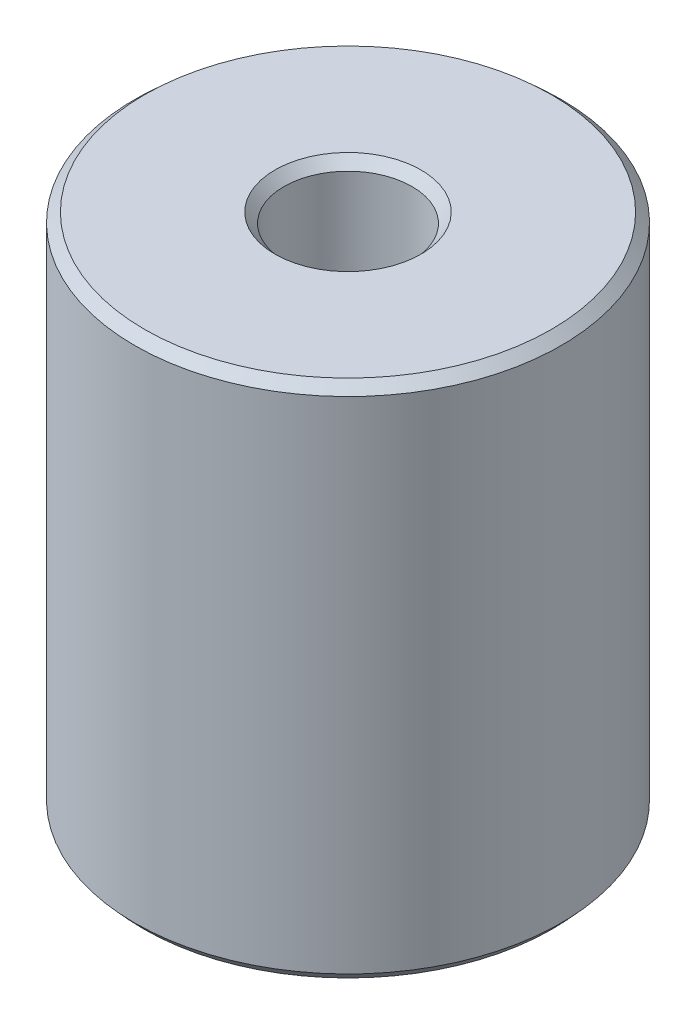
ISO-10303-21;
HEADER;
FILE_DESCRIPTION(('STEP AP214'),'2;1');
FILE_NAME('part.step','',(''),(''),'','','');
FILE_SCHEMA(('AUTOMOTIVE_DESIGN { 1 0 10303 214 1 1 1 1 }'));
ENDSEC;
DATA;
#1=APPLICATION_CONTEXT('core data for automotive mechanical design processes');
#2=APPLICATION_PROTOCOL_DEFINITION('international standard','automotive_design',2000,#1);
#3=PRODUCT_CONTEXT('',#1,'mechanical');
#4=PRODUCT('Part','Part','',(#3));
#5=PRODUCT_RELATED_PRODUCT_CATEGORY('part','',(#4));
#6=PRODUCT_DEFINITION_FORMATION('','',#4);
#7=PRODUCT_DEFINITION_CONTEXT('part definition',#1,'design');
#8=PRODUCT_DEFINITION('design','',#6,#7);
#9=PRODUCT_DEFINITION_SHAPE('','',#8);
#10=(LENGTH_UNIT() NAMED_UNIT(*) SI_UNIT(.MILLI.,.METRE.));
#11=(NAMED_UNIT(*) PLANE_ANGLE_UNIT() SI_UNIT($,.RADIAN.));
#12=(NAMED_UNIT(*) SI_UNIT($,.STERADIAN.) SOLID_ANGLE_UNIT());
#13=UNCERTAINTY_MEASURE_WITH_UNIT(LENGTH_MEASURE(1.E-05),#10,'distance_accuracy_value','');
#14=(GEOMETRIC_REPRESENTATION_CONTEXT(3) GLOBAL_UNCERTAINTY_ASSIGNED_CONTEXT((#13)) GLOBAL_UNIT_ASSIGNED_CONTEXT((#10,
#11,#12)) REPRESENTATION_CONTEXT('',''));
#15=CARTESIAN_POINT('',(0.,0.,0.));
#16=DIRECTION('',(0.,0.,1.));
#17=DIRECTION('',(1.,0.,0.));
#18=AXIS2_PLACEMENT_3D('',#15,#16,#17);
#19=CARTESIAN_POINT('',(0.,12.169899260072,0.));
#20=DIRECTION('',(0.,-1.,0.));
#21=DIRECTION('',(0.,0.,-1.));
#22=AXIS2_PLACEMENT_3D('',#19,#20,#21);
#23=CYLINDRICAL_SURFACE('',#22,5.);
#24=CARTESIAN_POINT('',(0.,0.230903095628844,0.));
#25=DIRECTION('',(0.,1.,0.));
#26=DIRECTION('',(0.,0.,1.));
#27=AXIS2_PLACEMENT_3D('',#24,#25,#26);
#28=CIRCLE('',#27,5.);
#29=CARTESIAN_POINT('',(0.,0.230903095628844,5.));
#30=VERTEX_POINT('',#29);
#31=EDGE_CURVE('E10',#30,#30,#28,.T.);
#32=ORIENTED_EDGE('',*,*,#31,.T.);
#33=EDGE_LOOP('',(#32));
#34=FACE_BOUND('',#33,.T.);
#35=CARTESIAN_POINT('',(0.,11.9579597781357,0.));
#36=DIRECTION('',(0.,1.,0.));
#37=DIRECTION('',(0.,0.,1.));
#38=AXIS2_PLACEMENT_3D('',#35,#36,#37);
#39=CIRCLE('',#38,5.);
#40=CARTESIAN_POINT('',(0.,11.9579597781357,-5.));
#41=VERTEX_POINT('',#40);
#42=EDGE_CURVE('E50',#41,#41,#39,.F.);
#43=ORIENTED_EDGE('',*,*,#42,.T.);
#44=EDGE_LOOP('',(#43));
#45=FACE_BOUND('',#44,.T.);
#46=ADVANCED_FACE('F39',(#34,#45),#23,.T.);
#47=CARTESIAN_POINT('',(0.,12.169899260072,0.));
#48=DIRECTION('',(0.,1.,0.));
#49=DIRECTION('',(0.,0.,1.));
#50=AXIS2_PLACEMENT_3D('',#47,#48,#49);
#51=PLANE('',#50);
#52=CARTESIAN_POINT('',(0.,12.169899260072,0.));
#53=DIRECTION('',(0.,1.,0.));
#54=DIRECTION('',(0.,0.,1.));
#55=AXIS2_PLACEMENT_3D('',#52,#53,#54);
#56=CIRCLE('',#55,1.71234042723576);
#57=CARTESIAN_POINT('',(0.,12.169899260072,1.71234042723576));
#58=VERTEX_POINT('',#57);
#59=EDGE_CURVE('E58',#58,#58,#56,.F.);
#60=ORIENTED_EDGE('',*,*,#59,.T.);
#61=EDGE_LOOP('',(#60));
#62=FACE_BOUND('',#61,.T.);
#63=CARTESIAN_POINT('',(0.,12.169899260072,0.));
#64=DIRECTION('',(0.,1.,0.));
#65=DIRECTION('',(0.,0.,1.));
#66=AXIS2_PLACEMENT_3D('',#63,#64,#65);
#67=CIRCLE('',#66,4.76909690437116);
#68=CARTESIAN_POINT('',(0.,12.169899260072,-4.76909690437116));
#69=VERTEX_POINT('',#68);
#70=EDGE_CURVE('E61',#69,#69,#67,.T.);
#71=ORIENTED_EDGE('',*,*,#70,.T.);
#72=EDGE_LOOP('',(#71));
#73=FACE_BOUND('',#72,.T.);
#74=ADVANCED_FACE('F88',(#62,#73),#51,.T.);
#75=CARTESIAN_POINT('',(0.,0.,0.));
#76=DIRECTION('',(0.,1.,0.));
#77=DIRECTION('',(0.,0.,1.));
#78=AXIS2_PLACEMENT_3D('',#75,#76,#77);
#79=PLANE('',#78);
#80=CARTESIAN_POINT('',(0.,0.,0.));
#81=DIRECTION('',(0.,1.,0.));
#82=DIRECTION('',(0.,0.,1.));
#83=AXIS2_PLACEMENT_3D('',#80,#81,#82);
#84=CIRCLE('',#83,1.73130404092828);
#85=CARTESIAN_POINT('',(0.,0.,-1.73130404092828));
#86=VERTEX_POINT('',#85);
#87=EDGE_CURVE('E51',#86,#86,#84,.T.);
#88=ORIENTED_EDGE('',*,*,#87,.T.);
#89=EDGE_LOOP('',(#88));
#90=FACE_BOUND('',#89,.T.);
#91=CARTESIAN_POINT('',(0.,0.,0.));
#92=DIRECTION('',(0.,1.,0.));
#93=DIRECTION('',(0.,0.,1.));
#94=AXIS2_PLACEMENT_3D('',#91,#92,#93);
#95=CIRCLE('',#94,4.78806051806368);
#96=CARTESIAN_POINT('',(0.,0.,4.78806051806368));
#97=VERTEX_POINT('',#96);
#98=EDGE_CURVE('E54',#97,#97,#95,.F.);
#99=ORIENTED_EDGE('',*,*,#98,.T.);
#100=EDGE_LOOP('',(#99));
#101=FACE_BOUND('',#100,.T.);
#102=ADVANCED_FACE('F83',(#90,#101),#79,.F.);
#103=CARTESIAN_POINT('',(0.,12.169899260072,0.));
#104=DIRECTION('',(0.,-1.,0.));
#105=DIRECTION('',(0.,0.,-1.));
#106=AXIS2_PLACEMENT_3D('',#103,#104,#105);
#107=CYLINDRICAL_SURFACE('',#106,1.50040094529944);
#108=CARTESIAN_POINT('',(0.,11.9389961644432,0.));
#109=DIRECTION('',(0.,1.,0.));
#110=DIRECTION('',(0.,0.,1.));
#111=AXIS2_PLACEMENT_3D('',#108,#109,#110);
#112=CIRCLE('',#111,1.50040094529944);
#113=CARTESIAN_POINT('',(0.,11.9389961644432,1.50040094529944));
#114=VERTEX_POINT('',#113);
#115=EDGE_CURVE('E67',#114,#114,#112,.T.);
#116=ORIENTED_EDGE('',*,*,#115,.T.);
#117=EDGE_LOOP('',(#116));
#118=FACE_BOUND('',#117,.T.);
#119=CARTESIAN_POINT('',(0.,0.211939481936315,0.));
#120=DIRECTION('',(0.,1.,0.));
#121=DIRECTION('',(0.,0.,1.));
#122=AXIS2_PLACEMENT_3D('',#119,#120,#121);
#123=CIRCLE('',#122,1.50040094529944);
#124=CARTESIAN_POINT('',(0.,0.211939481936315,-1.50040094529944));
#125=VERTEX_POINT('',#124);
#126=EDGE_CURVE('E69',#125,#125,#123,.F.);
#127=ORIENTED_EDGE('',*,*,#126,.T.);
#128=EDGE_LOOP('',(#127));
#129=FACE_BOUND('',#128,.T.);
#130=ADVANCED_FACE('F71',(#118,#129),#107,.F.);
#131=CARTESIAN_POINT('',(0.,11.9389961644432,0.));
#132=DIRECTION('',(0.,1.,0.));
#133=DIRECTION('',(0.,0.,1.));
#134=AXIS2_PLACEMENT_3D('',#131,#132,#133);
#135=CONICAL_SURFACE('',#134,1.50040094529944,0.742601838491257);
#136=ORIENTED_EDGE('',*,*,#59,.F.);
#137=EDGE_LOOP('',(#136));
#138=FACE_BOUND('',#137,.T.);
#139=ORIENTED_EDGE('',*,*,#115,.F.);
#140=EDGE_LOOP('',(#139));
#141=FACE_BOUND('',#140,.T.);
#142=ADVANCED_FACE('F77',(#138,#141),#135,.F.);
#143=CARTESIAN_POINT('',(0.,0.,0.));
#144=DIRECTION('',(0.,-1.,0.));
#145=DIRECTION('',(0.,0.,-1.));
#146=AXIS2_PLACEMENT_3D('',#143,#144,#145);
#147=CONICAL_SURFACE('',#146,1.73130404092828,0.828194488303637);
#148=CARTESIAN_POINT('',(0.,0.211939481936315,-1.50040094529944));
#149=CARTESIAN_POINT('',(0.,0.209731778999478,-1.50280618587891));
#150=CARTESIAN_POINT('',(0.,0.207524076062642,-1.50521142645838));
#151=CARTESIAN_POINT('',(0.,0.203108670188969,-1.51002190761731));
#152=CARTESIAN_POINT('',(0.,0.200900967252132,-1.51242714819678));
#153=CARTESIAN_POINT('',(0.,0.196485561378459,-1.51723762935571));
#154=CARTESIAN_POINT('',(0.,0.194277858441622,-1.51964286993518));
#155=CARTESIAN_POINT('',(0.,0.189862452567949,-1.52445335109411));
#156=CARTESIAN_POINT('',(0.,0.187654749631112,-1.52685859167358));
#157=CARTESIAN_POINT('',(0.,0.183239343757439,-1.53166907283252));
#158=CARTESIAN_POINT('',(0.,0.181031640820602,-1.53407431341198));
#159=CARTESIAN_POINT('',(0.,0.176616234946929,-1.53888479457092));
#160=CARTESIAN_POINT('',(0.,0.174408532010093,-1.54129003515038));
#161=CARTESIAN_POINT('',(0.,0.169993126136419,-1.54610051630932));
#162=CARTESIAN_POINT('',(0.,0.167785423199583,-1.54850575688879));
#163=CARTESIAN_POINT('',(0.,0.163370017325909,-1.55331623804772));
#164=CARTESIAN_POINT('',(0.,0.161162314389073,-1.55572147862719));
#165=CARTESIAN_POINT('',(0.,0.1567469085154,-1.56053195978612));
#166=CARTESIAN_POINT('',(0.,0.154539205578563,-1.56293720036559));
#167=CARTESIAN_POINT('',(0.,0.15012379970489,-1.56774768152452));
#168=CARTESIAN_POINT('',(0.,0.147916096768053,-1.57015292210399));
#169=CARTESIAN_POINT('',(0.,0.14350069089438,-1.57496340326292));
#170=CARTESIAN_POINT('',(0.,0.141292987957543,-1.57736864384239));
#171=CARTESIAN_POINT('',(0.,0.13687758208387,-1.58217912500132));
#172=CARTESIAN_POINT('',(0.,0.134669879147033,-1.58458436558079));
#173=CARTESIAN_POINT('',(0.,0.13025447327336,-1.58939484673973));
#174=CARTESIAN_POINT('',(0.,0.128046770336524,-1.59180008731919));
#175=CARTESIAN_POINT('',(0.,0.12363136446285,-1.59661056847813));
#176=CARTESIAN_POINT('',(0.,0.121423661526014,-1.59901580905759));
#177=CARTESIAN_POINT('',(0.,0.117008255652341,-1.60382629021653));
#178=CARTESIAN_POINT('',(0.,0.114800552715504,-1.606231530796));
#179=CARTESIAN_POINT('',(0.,0.110385146841831,-1.61104201195493));
#180=CARTESIAN_POINT('',(0.,0.108177443904994,-1.6134472525344));
#181=CARTESIAN_POINT('',(0.,0.103762038031321,-1.61825773369333));
#182=CARTESIAN_POINT('',(0.,0.101554335094484,-1.6206629742728));
#183=CARTESIAN_POINT('',(0.,0.097138929220811,-1.62547345543173));
#184=CARTESIAN_POINT('',(0.,0.0949312262839744,-1.6278786960112));
#185=CARTESIAN_POINT('',(0.,0.0905158204103012,-1.63268917717013));
#186=CARTESIAN_POINT('',(0.,0.0883081174734646,-1.6350944177496));
#187=CARTESIAN_POINT('',(0.,0.0838927115997913,-1.63990489890853));
#188=CARTESIAN_POINT('',(0.,0.0816850086629548,-1.642310139488));
#189=CARTESIAN_POINT('',(0.,0.0772696027892815,-1.64712062064694));
#190=CARTESIAN_POINT('',(0.,0.0750618998524449,-1.6495258612264));
#191=CARTESIAN_POINT('',(0.,0.0706464939787717,-1.65433634238534));
#192=CARTESIAN_POINT('',(0.,0.0684387910419351,-1.6567415829648));
#193=CARTESIAN_POINT('',(0.,0.0640233851682619,-1.66155206412374));
#194=CARTESIAN_POINT('',(0.,0.0618156822314252,-1.66395730470321));
#195=CARTESIAN_POINT('',(0.,0.057400276357752,-1.66876778586214));
#196=CARTESIAN_POINT('',(0.,0.0551925734209153,-1.67117302644161));
#197=CARTESIAN_POINT('',(0.,0.0507771675472421,-1.67598350760054));
#198=CARTESIAN_POINT('',(0.,0.0485694646104055,-1.67838874818001));
#199=CARTESIAN_POINT('',(0.,0.0441540587367323,-1.68319922933894));
#200=CARTESIAN_POINT('',(0.,0.0419463557998957,-1.68560446991841));
#201=CARTESIAN_POINT('',(0.,0.0375309499262224,-1.69041495107734));
#202=CARTESIAN_POINT('',(0.,0.0353232469893859,-1.69282019165681));
#203=CARTESIAN_POINT('',(0.,0.0309078411157126,-1.69763067281574));
#204=CARTESIAN_POINT('',(0.,0.028700138178876,-1.70003591339521));
#205=CARTESIAN_POINT('',(0.,0.0242847323052027,-1.70484639455414));
#206=CARTESIAN_POINT('',(0.,0.0220770293683662,-1.70725163513361));
#207=CARTESIAN_POINT('',(0.,0.0176616234946929,-1.71206211629255));
#208=CARTESIAN_POINT('',(0.,0.0154539205578563,-1.71446735687201));
#209=CARTESIAN_POINT('',(0.,0.0110385146841831,-1.71927783803095));
#210=CARTESIAN_POINT('',(0.,0.00883081174734646,-1.72168307861041));
#211=CARTESIAN_POINT('',(0.,0.00441540587367327,-1.72649355976935));
#212=CARTESIAN_POINT('',(0.,0.00220770293683667,-1.72889880034882));
#213=CARTESIAN_POINT('',(0.,0.,-1.73130404092828));
#214=B_SPLINE_CURVE_WITH_KNOTS('',3,(#148,#149,#150,#151,#152,#153,#154,#155,#156,#157,#158,
#159,#160,#161,#162,#163,#164,#165,#166,#167,#168,#169,#170,#171,#172,#173,#174,#175,#176,#177,
#178,#179,#180,#181,#182,#183,#184,#185,#186,#187,#188,#189,#190,#191,#192,#193,#194,#195,#196,
#197,#198,#199,#200,#201,#202,#203,#204,#205,#206,#207,#208,#209,#210,#211,#212,#213),
.UNSPECIFIED.,.F.,.F.,(4,2,2,2,2,2,2,2,2,2,2,2,2,2,2,2,2,2,2,2,2,2,2,2,2,2,2,2,2,2,2,2,4),(0.,
0.00979449899289855,0.0195889979857969,0.0293834969786953,0.0391779959715939,0.0489724949644923,
0.0587669939573908,0.0685614929502892,0.0783559919431878,0.0881504909360862,0.0979449899289845,
0.107739488921883,0.117533987914781,0.12732848690768,0.137122985900578,0.146917484893477,
0.156711983886375,0.166506482879274,0.176300981872172,0.186095480865071,0.195889979857969,
0.205684478850868,0.215478977843766,0.225273476836665,0.235067975829563,0.244862474822462,
0.25465697381536,0.264451472808258,0.274245971801157,0.284040470794055,0.293834969786954,
0.303629468779852,0.313423967772751),.UNSPECIFIED.);
#215=EDGE_CURVE('BSEAM73',#125,#86,#214,.T.);
#216=ORIENTED_EDGE('',*,*,#126,.F.);
#217=ORIENTED_EDGE('',*,*,#87,.F.);
#218=ORIENTED_EDGE('',*,*,#215,.T.);
#219=ORIENTED_EDGE('',*,*,#215,.F.);
#220=EDGE_LOOP('',(#216,#218,#217,#219));
#221=FACE_BOUND('',#220,.T.);
#222=ADVANCED_FACE('F73',(#221),#147,.F.);
#223=CARTESIAN_POINT('',(0.,0.230903095628844,0.));
#224=DIRECTION('',(0.,1.,0.));
#225=DIRECTION('',(0.,0.,1.));
#226=AXIS2_PLACEMENT_3D('',#223,#224,#225);
#227=CONICAL_SURFACE('',#226,5.,0.742601838491254);
#228=ORIENTED_EDGE('',*,*,#98,.F.);
#229=EDGE_LOOP('',(#228));
#230=FACE_BOUND('',#229,.T.);
#231=ORIENTED_EDGE('',*,*,#31,.F.);
#232=EDGE_LOOP('',(#231));
#233=FACE_BOUND('',#232,.T.);
#234=ADVANCED_FACE('F76',(#230,#233),#227,.T.);
#235=CARTESIAN_POINT('',(0.,12.169899260072,0.));
#236=DIRECTION('',(0.,-1.,0.));
#237=DIRECTION('',(0.,0.,-1.));
#238=AXIS2_PLACEMENT_3D('',#235,#236,#237);
#239=CONICAL_SURFACE('',#238,4.76909690437116,0.828194488303635);
#240=CARTESIAN_POINT('',(0.,11.9579597781357,-5.));
#241=CARTESIAN_POINT('',(0.,11.9601674810725,-4.99759475942053));
#242=CARTESIAN_POINT('',(0.,11.9623751840094,-4.99518951884107));
#243=CARTESIAN_POINT('',(0.,11.966790589883,-4.99037903768213));
#244=CARTESIAN_POINT('',(0.,11.9689982928199,-4.98797379710267));
#245=CARTESIAN_POINT('',(0.,11.9734136986935,-4.98316331594373));
#246=CARTESIAN_POINT('',(0.,11.9756214016304,-4.98075807536426));
#247=CARTESIAN_POINT('',(0.,11.9800368075041,-4.97594759420533));
#248=CARTESIAN_POINT('',(0.,11.9822445104409,-4.97354235362586));
#249=CARTESIAN_POINT('',(0.,11.9866599163146,-4.96873187246693));
#250=CARTESIAN_POINT('',(0.,11.9888676192514,-4.96632663188746));
#251=CARTESIAN_POINT('',(0.,11.9932830251251,-4.96151615072853));
#252=CARTESIAN_POINT('',(0.,11.9954907280619,-4.95911091014906));
#253=CARTESIAN_POINT('',(0.,11.9999061339356,-4.95430042899013));
#254=CARTESIAN_POINT('',(0.,12.0021138368724,-4.95189518841066));
#255=CARTESIAN_POINT('',(0.,12.0065292427461,-4.94708470725172));
#256=CARTESIAN_POINT('',(0.,12.0087369456829,-4.94467946667226));
#257=CARTESIAN_POINT('',(0.,12.0131523515566,-4.93986898551332));
#258=CARTESIAN_POINT('',(0.,12.0153600544934,-4.93746374493386));
#259=CARTESIAN_POINT('',(0.,12.0197754603671,-4.93265326377492));
#260=CARTESIAN_POINT('',(0.,12.021983163304,-4.93024802319546));
#261=CARTESIAN_POINT('',(0.,12.0263985691776,-4.92543754203652));
#262=CARTESIAN_POINT('',(0.,12.0286062721145,-4.92303230145705));
#263=CARTESIAN_POINT('',(0.,12.0330216779881,-4.91822182029812));
#264=CARTESIAN_POINT('',(0.,12.035229380925,-4.91581657971865));
#265=CARTESIAN_POINT('',(0.,12.0396447867987,-4.91100609855972));
#266=CARTESIAN_POINT('',(0.,12.0418524897355,-4.90860085798025));
#267=CARTESIAN_POINT('',(0.,12.0462678956092,-4.90379037682132));
#268=CARTESIAN_POINT('',(0.,12.048475598546,-4.90138513624185));
#269=CARTESIAN_POINT('',(0.,12.0528910044197,-4.89657465508292));
#270=CARTESIAN_POINT('',(0.,12.0550987073565,-4.89416941450345));
#271=CARTESIAN_POINT('',(0.,12.0595141132302,-4.88935893334451));
#272=CARTESIAN_POINT('',(0.,12.061721816167,-4.88695369276505));
#273=CARTESIAN_POINT('',(0.,12.0661372220407,-4.88214321160611));
#274=CARTESIAN_POINT('',(0.,12.0683449249775,-4.87973797102665));
#275=CARTESIAN_POINT('',(0.,12.0727603308512,-4.87492748986771));
#276=CARTESIAN_POINT('',(0.,12.074968033788,-4.87252224928825));
#277=CARTESIAN_POINT('',(0.,12.0793834396617,-4.86771176812931));
#278=CARTESIAN_POINT('',(0.,12.0815911425985,-4.86530652754984));
#279=CARTESIAN_POINT('',(0.,12.0860065484722,-4.86049604639091));
#280=CARTESIAN_POINT('',(0.,12.0882142514091,-4.85809080581144));
#281=CARTESIAN_POINT('',(0.,12.0926296572827,-4.85328032465251));
#282=CARTESIAN_POINT('',(0.,12.0948373602196,-4.85087508407304));
#283=CARTESIAN_POINT('',(0.,12.0992527660932,-4.84606460291411));
#284=CARTESIAN_POINT('',(0.,12.1014604690301,-4.84365936233464));
#285=CARTESIAN_POINT('',(0.,12.1058758749037,-4.83884888117571));
#286=CARTESIAN_POINT('',(0.,12.1080835778406,-4.83644364059624));
#287=CARTESIAN_POINT('',(0.,12.1124989837143,-4.8316331594373));
#288=CARTESIAN_POINT('',(0.,12.1147066866511,-4.82922791885784));
#289=CARTESIAN_POINT('',(0.,12.1191220925248,-4.8244174376989));
#290=CARTESIAN_POINT('',(0.,12.1213297954616,-4.82201219711944));
#291=CARTESIAN_POINT('',(0.,12.1257452013353,-4.8172017159605));
#292=CARTESIAN_POINT('',(0.,12.1279529042721,-4.81479647538103));
#293=CARTESIAN_POINT('',(0.,12.1323683101458,-4.8099859942221));
#294=CARTESIAN_POINT('',(0.,12.1345760130826,-4.80758075364263));
#295=CARTESIAN_POINT('',(0.,12.1389914189563,-4.8027702724837));
#296=CARTESIAN_POINT('',(0.,12.1411991218931,-4.80036503190423));
#297=CARTESIAN_POINT('',(0.,12.1456145277668,-4.7955545507453));
#298=CARTESIAN_POINT('',(0.,12.1478222307036,-4.79314931016583));
#299=CARTESIAN_POINT('',(0.,12.1522376365773,-4.7883388290069));
#300=CARTESIAN_POINT('',(0.,12.1544453395142,-4.78593358842743));
#301=CARTESIAN_POINT('',(0.,12.1588607453878,-4.78112310726849));
#302=CARTESIAN_POINT('',(0.,12.1610684483247,-4.77871786668903));
#303=CARTESIAN_POINT('',(0.,12.1654838541983,-4.77390738553009));
#304=CARTESIAN_POINT('',(0.,12.1676915571352,-4.77150214495063));
#305=CARTESIAN_POINT('',(0.,12.169899260072,-4.76909690437116));
#306=B_SPLINE_CURVE_WITH_KNOTS('',3,(#240,#241,#242,#243,#244,#245,#246,#247,#248,#249,#250,
#251,#252,#253,#254,#255,#256,#257,#258,#259,#260,#261,#262,#263,#264,#265,#266,#267,#268,#269,
#270,#271,#272,#273,#274,#275,#276,#277,#278,#279,#280,#281,#282,#283,#284,#285,#286,#287,#288,
#289,#290,#291,#292,#293,#294,#295,#296,#297,#298,#299,#300,#301,#302,#303,#304,#305),
.UNSPECIFIED.,.F.,.F.,(4,2,2,2,2,2,2,2,2,2,2,2,2,2,2,2,2,2,2,2,2,2,2,2,2,2,2,2,2,2,2,2,4),(0.,
0.00979449899289862,0.0195889979857972,0.0293834969786959,0.0391779959715945,0.0489724949644931,
0.0587669939573917,0.0685614929502904,0.078355991943189,0.0881504909360876,0.0979449899289862,
0.107739488921884,0.117533987914784,0.127328486907683,0.13712298590058,0.146917484893479,
0.156711983886377,0.166506482879276,0.176300981872175,0.186095480865073,0.195889979857972,
0.20568447885087,0.215478977843769,0.225273476836668,0.235067975829568,0.244862474822466,
0.254656973815365,0.264451472808263,0.274245971801162,0.284040470794061,0.293834969786959,
0.303629468779858,0.313423967772757),.UNSPECIFIED.);
#307=EDGE_CURVE('BSEAM45',#41,#69,#306,.T.);
#308=ORIENTED_EDGE('',*,*,#42,.F.);
#309=ORIENTED_EDGE('',*,*,#70,.F.);
#310=ORIENTED_EDGE('',*,*,#307,.T.);
#311=ORIENTED_EDGE('',*,*,#307,.F.);
#312=EDGE_LOOP('',(#308,#310,#309,#311));
#313=FACE_BOUND('',#312,.T.);
#314=ADVANCED_FACE('F45',(#313),#239,.T.);
#315=CLOSED_SHELL('',(#46,#74,#102,#130,#142,#222,#234,#314));
#316=MANIFOLD_SOLID_BREP('B2',#315);
#317=ADVANCED_BREP_SHAPE_REPRESENTATION('',(#18,#316),#14);
#318=SHAPE_DEFINITION_REPRESENTATION(#9,#317);
ENDSEC;
END-ISO-10303-21;
